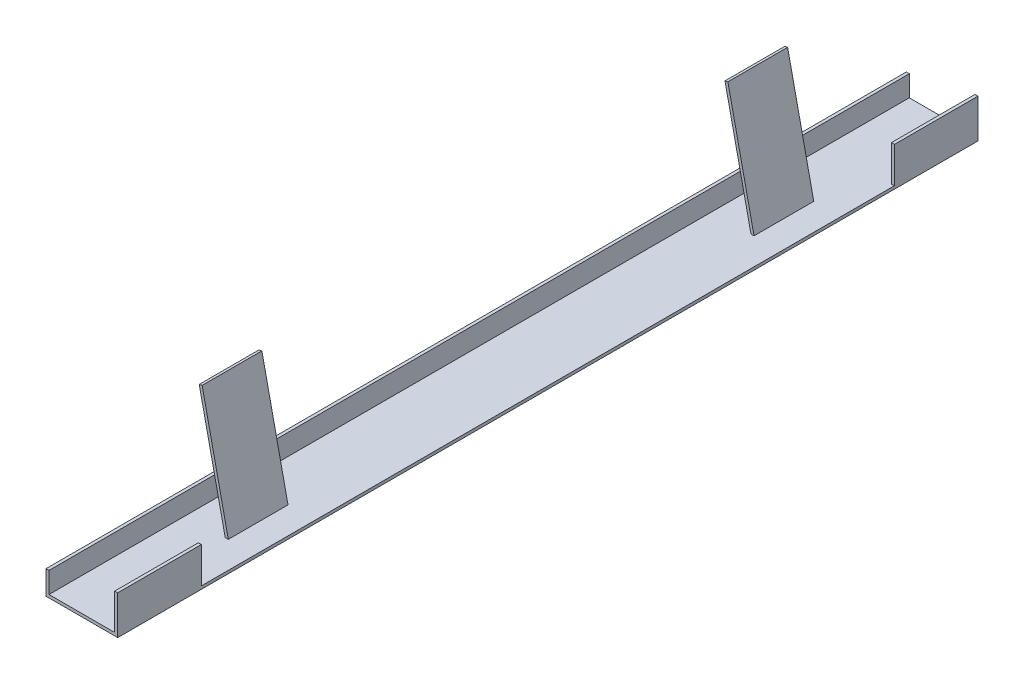
ISO-10303-21;
HEADER;
FILE_DESCRIPTION(('STEP AP214'),'2;1');
FILE_NAME('part.step','',(''),(''),'','','');
FILE_SCHEMA(('AUTOMOTIVE_DESIGN { 1 0 10303 214 1 1 1 1 }'));
ENDSEC;
DATA;
#1=APPLICATION_CONTEXT('core data for automotive mechanical design processes');
#2=APPLICATION_PROTOCOL_DEFINITION('international standard','automotive_design',2000,#1);
#3=PRODUCT_CONTEXT('',#1,'mechanical');
#4=PRODUCT('Part','Part','',(#3));
#5=PRODUCT_RELATED_PRODUCT_CATEGORY('part','',(#4));
#6=PRODUCT_DEFINITION_FORMATION('','',#4);
#7=PRODUCT_DEFINITION_CONTEXT('part definition',#1,'design');
#8=PRODUCT_DEFINITION('design','',#6,#7);
#9=PRODUCT_DEFINITION_SHAPE('','',#8);
#10=(LENGTH_UNIT() NAMED_UNIT(*) SI_UNIT(.MILLI.,.METRE.));
#11=(NAMED_UNIT(*) PLANE_ANGLE_UNIT() SI_UNIT($,.RADIAN.));
#12=(NAMED_UNIT(*) SI_UNIT($,.STERADIAN.) SOLID_ANGLE_UNIT());
#13=UNCERTAINTY_MEASURE_WITH_UNIT(LENGTH_MEASURE(1.E-05),#10,'distance_accuracy_value','');
#14=(GEOMETRIC_REPRESENTATION_CONTEXT(3) GLOBAL_UNCERTAINTY_ASSIGNED_CONTEXT((#13)) GLOBAL_UNIT_ASSIGNED_CONTEXT((#10,
#11,#12)) REPRESENTATION_CONTEXT('',''));
#15=CARTESIAN_POINT('',(0.,0.,0.));
#16=DIRECTION('',(0.,0.,1.));
#17=DIRECTION('',(1.,0.,0.));
#18=AXIS2_PLACEMENT_3D('',#15,#16,#17);
#19=CARTESIAN_POINT('',(139.7,0.,228.6));
#20=DIRECTION('',(-1.,0.,0.));
#21=DIRECTION('',(0.,0.,1.));
#22=AXIS2_PLACEMENT_3D('',#19,#20,#21);
#23=PLANE('',#22);
#24=DIRECTION('',(0.,1.,0.));
#25=VECTOR('',#24,1.);
#26=CARTESIAN_POINT('',(139.7,1.5875,-184.15));
#27=LINE('',#26,#25);
#28=CARTESIAN_POINT('',(139.7,1.5875,-184.15));
#29=VERTEX_POINT('',#28);
#30=CARTESIAN_POINT('',(139.7,20.6375,-184.15));
#31=VERTEX_POINT('',#30);
#32=EDGE_CURVE('E184',#29,#31,#27,.T.);
#33=ORIENTED_EDGE('',*,*,#32,.F.);
#34=DIRECTION('',(0.,0.,1.));
#35=VECTOR('',#34,1.);
#36=CARTESIAN_POINT('',(139.7,1.5875,-184.15));
#37=LINE('',#36,#35);
#38=CARTESIAN_POINT('',(139.7,1.5875,184.15));
#39=VERTEX_POINT('',#38);
#40=EDGE_CURVE('E171',#29,#39,#37,.T.);
#41=ORIENTED_EDGE('',*,*,#40,.T.);
#42=DIRECTION('',(0.,1.,0.));
#43=VECTOR('',#42,1.);
#44=CARTESIAN_POINT('',(139.7,1.5875,184.15));
#45=LINE('',#44,#43);
#46=CARTESIAN_POINT('',(139.7,20.6375,184.15));
#47=VERTEX_POINT('',#46);
#48=EDGE_CURVE('E198',#39,#47,#45,.T.);
#49=ORIENTED_EDGE('',*,*,#48,.T.);
#50=DIRECTION('',(0.,0.,-1.));
#51=VECTOR('',#50,1.);
#52=CARTESIAN_POINT('',(139.7,20.6375,228.6));
#53=LINE('',#52,#51);
#54=CARTESIAN_POINT('',(139.7,20.6375,228.6));
#55=VERTEX_POINT('',#54);
#56=EDGE_CURVE('E299',#55,#47,#53,.T.);
#57=ORIENTED_EDGE('',*,*,#56,.F.);
#58=DIRECTION('',(0.,1.,0.));
#59=VECTOR('',#58,1.);
#60=CARTESIAN_POINT('',(139.7,0.,228.6));
#61=LINE('',#60,#59);
#62=CARTESIAN_POINT('',(139.7,0.,228.6));
#63=VERTEX_POINT('',#62);
#64=EDGE_CURVE('E248',#63,#55,#61,.T.);
#65=ORIENTED_EDGE('',*,*,#64,.F.);
#66=DIRECTION('',(0.,0.,-1.));
#67=VECTOR('',#66,1.);
#68=CARTESIAN_POINT('',(139.7,0.,228.6));
#69=LINE('',#68,#67);
#70=CARTESIAN_POINT('',(139.7,0.,-228.6));
#71=VERTEX_POINT('',#70);
#72=EDGE_CURVE('E302',#63,#71,#69,.T.);
#73=ORIENTED_EDGE('',*,*,#72,.T.);
#74=DIRECTION('',(0.,1.,0.));
#75=VECTOR('',#74,1.);
#76=CARTESIAN_POINT('',(139.7,0.,-228.6));
#77=LINE('',#76,#75);
#78=CARTESIAN_POINT('',(139.7,20.6375,-228.6));
#79=VERTEX_POINT('',#78);
#80=EDGE_CURVE('E265',#71,#79,#77,.T.);
#81=ORIENTED_EDGE('',*,*,#80,.T.);
#82=EDGE_CURVE('E189',#31,#79,#53,.T.);
#83=ORIENTED_EDGE('',*,*,#82,.F.);
#84=EDGE_LOOP('',(#33,#41,#49,#57,#65,#73,#81,#83));
#85=FACE_BOUND('',#84,.T.);
#86=ADVANCED_FACE('F31',(#85),#23,.F.);
#87=CARTESIAN_POINT('',(139.7,20.6375,228.6));
#88=DIRECTION('',(0.,-1.,0.));
#89=DIRECTION('',(0.,0.,-1.));
#90=AXIS2_PLACEMENT_3D('',#87,#88,#89);
#91=PLANE('',#90);
#92=DIRECTION('',(-1.,0.,0.));
#93=VECTOR('',#92,1.);
#94=CARTESIAN_POINT('',(139.7,20.6375,-184.15));
#95=LINE('',#94,#93);
#96=CARTESIAN_POINT('',(138.1125,20.6375,-184.15));
#97=VERTEX_POINT('',#96);
#98=EDGE_CURVE('E181',#31,#97,#95,.T.);
#99=ORIENTED_EDGE('',*,*,#98,.F.);
#100=ORIENTED_EDGE('',*,*,#82,.T.);
#101=DIRECTION('',(-1.,0.,0.));
#102=VECTOR('',#101,1.);
#103=CARTESIAN_POINT('',(139.7,20.6375,-228.6));
#104=LINE('',#103,#102);
#105=CARTESIAN_POINT('',(138.1125,20.6375,-228.6));
#106=VERTEX_POINT('',#105);
#107=EDGE_CURVE('E267',#79,#106,#104,.T.);
#108=ORIENTED_EDGE('',*,*,#107,.T.);
#109=DIRECTION('',(0.,0.,-1.));
#110=VECTOR('',#109,1.);
#111=CARTESIAN_POINT('',(138.1125,20.6375,228.6));
#112=LINE('',#111,#110);
#113=EDGE_CURVE('E295',#97,#106,#112,.T.);
#114=ORIENTED_EDGE('',*,*,#113,.F.);
#115=EDGE_LOOP('',(#99,#100,#108,#114));
#116=FACE_BOUND('',#115,.T.);
#117=ADVANCED_FACE('F340',(#116),#91,.F.);
#118=CARTESIAN_POINT('',(138.1125,20.6375,228.6));
#119=DIRECTION('',(1.,0.,0.));
#120=DIRECTION('',(0.,0.,-1.));
#121=AXIS2_PLACEMENT_3D('',#118,#119,#120);
#122=PLANE('',#121);
#123=DIRECTION('',(0.,-1.,0.));
#124=VECTOR('',#123,1.);
#125=CARTESIAN_POINT('',(138.1125,20.6375,-184.15));
#126=LINE('',#125,#124);
#127=CARTESIAN_POINT('',(138.1125,1.5875,-184.15));
#128=VERTEX_POINT('',#127);
#129=EDGE_CURVE('E46',#97,#128,#126,.T.);
#130=ORIENTED_EDGE('',*,*,#129,.F.);
#131=ORIENTED_EDGE('',*,*,#113,.T.);
#132=DIRECTION('',(0.,-1.,0.));
#133=VECTOR('',#132,1.);
#134=CARTESIAN_POINT('',(138.1125,20.6375,-228.6));
#135=LINE('',#134,#133);
#136=CARTESIAN_POINT('',(138.1125,1.5875,-228.6));
#137=VERTEX_POINT('',#136);
#138=EDGE_CURVE('E270',#106,#137,#135,.T.);
#139=ORIENTED_EDGE('',*,*,#138,.T.);
#140=DIRECTION('',(0.,0.,-1.));
#141=VECTOR('',#140,1.);
#142=CARTESIAN_POINT('',(138.1125,1.5875,228.6));
#143=LINE('',#142,#141);
#144=EDGE_CURVE('E292',#128,#137,#143,.T.);
#145=ORIENTED_EDGE('',*,*,#144,.F.);
#146=EDGE_LOOP('',(#130,#131,#139,#145));
#147=FACE_BOUND('',#146,.T.);
#148=ADVANCED_FACE('F337',(#147),#122,.F.);
#149=CARTESIAN_POINT('',(125.44957879554,1.5875,228.6));
#150=DIRECTION('',(-0.977176363917546,-0.212429644355218,0.));
#151=DIRECTION('',(0.212429644355218,-0.977176363917546,0.));
#152=AXIS2_PLACEMENT_3D('',#149,#150,#151);
#153=PLANE('',#152);
#154=DIRECTION('',(-0.212429644355218,0.977176363917546,0.));
#155=VECTOR('',#154,1.);
#156=CARTESIAN_POINT('',(125.44957879554,1.5875,155.575));
#157=LINE('',#156,#155);
#158=CARTESIAN_POINT('',(125.44957879554,1.5875,155.575));
#159=VERTEX_POINT('',#158);
#160=CARTESIAN_POINT('',(111.54975300114,65.52669864662,155.575));
#161=VERTEX_POINT('',#160);
#162=EDGE_CURVE('E218',#159,#161,#157,.T.);
#163=ORIENTED_EDGE('',*,*,#162,.F.);
#164=DIRECTION('',(0.,0.,-1.));
#165=VECTOR('',#164,1.);
#166=CARTESIAN_POINT('',(125.44957879554,1.5875,228.6));
#167=LINE('',#166,#165);
#168=CARTESIAN_POINT('',(125.44957879554,1.5875,123.825));
#169=VERTEX_POINT('',#168);
#170=EDGE_CURVE('E290',#159,#169,#167,.T.);
#171=ORIENTED_EDGE('',*,*,#170,.T.);
#172=DIRECTION('',(-0.212429644355218,0.977176363917546,0.));
#173=VECTOR('',#172,1.);
#174=CARTESIAN_POINT('',(125.44957879554,1.5875,123.825));
#175=LINE('',#174,#173);
#176=CARTESIAN_POINT('',(111.54975300114,65.52669864662,123.825));
#177=VERTEX_POINT('',#176);
#178=EDGE_CURVE('E232',#169,#177,#175,.T.);
#179=ORIENTED_EDGE('',*,*,#178,.T.);
#180=DIRECTION('',(0.,0.,-1.));
#181=VECTOR('',#180,1.);
#182=CARTESIAN_POINT('',(111.54975300114,65.52669864662,228.6));
#183=LINE('',#182,#181);
#184=EDGE_CURVE('E287',#161,#177,#183,.T.);
#185=ORIENTED_EDGE('',*,*,#184,.F.);
#186=EDGE_LOOP('',(#163,#171,#179,#185));
#187=FACE_BOUND('',#186,.T.);
#188=ADVANCED_FACE('F348',(#187),#153,.F.);
#189=CARTESIAN_POINT('',(111.54975300114,65.52669864662,228.6));
#190=DIRECTION('',(0.212429643401076,-0.977176364124968,0.));
#191=DIRECTION('',(0.977176364124968,0.212429643401076,0.));
#192=AXIS2_PLACEMENT_3D('',#189,#190,#191);
#193=PLANE('',#192);
#194=DIRECTION('',(-0.977176364124968,-0.212429643401076,0.));
#195=VECTOR('',#194,1.);
#196=CARTESIAN_POINT('',(111.54975300114,65.52669864662,155.575));
#197=LINE('',#196,#195);
#198=CARTESIAN_POINT('',(109.99848552456,65.18946658804,155.575));
#199=VERTEX_POINT('',#198);
#200=EDGE_CURVE('E214',#161,#199,#197,.T.);
#201=ORIENTED_EDGE('',*,*,#200,.F.);
#202=ORIENTED_EDGE('',*,*,#184,.T.);
#203=DIRECTION('',(-0.977176364124968,-0.212429643401076,0.));
#204=VECTOR('',#203,1.);
#205=CARTESIAN_POINT('',(111.54975300114,65.52669864662,123.825));
#206=LINE('',#205,#204);
#207=CARTESIAN_POINT('',(109.99848552456,65.18946658804,123.825));
#208=VERTEX_POINT('',#207);
#209=EDGE_CURVE('E224',#177,#208,#206,.T.);
#210=ORIENTED_EDGE('',*,*,#209,.T.);
#211=DIRECTION('',(0.,0.,-1.));
#212=VECTOR('',#211,1.);
#213=CARTESIAN_POINT('',(109.99848552456,65.18946658804,228.6));
#214=LINE('',#213,#212);
#215=EDGE_CURVE('E284',#199,#208,#214,.T.);
#216=ORIENTED_EDGE('',*,*,#215,.F.);
#217=EDGE_LOOP('',(#201,#202,#210,#216));
#218=FACE_BOUND('',#217,.T.);
#219=ADVANCED_FACE('F400',(#218),#193,.F.);
#220=CARTESIAN_POINT('',(109.99848552456,65.18946658804,228.6));
#221=DIRECTION('',(0.977176363923505,0.212429644327803,0.));
#222=DIRECTION('',(-0.212429644327804,0.977176363923505,0.));
#223=AXIS2_PLACEMENT_3D('',#220,#221,#222);
#224=PLANE('',#223);
#225=DIRECTION('',(0.212429644327804,-0.977176363923505,0.));
#226=VECTOR('',#225,1.);
#227=CARTESIAN_POINT('',(109.99848552456,65.18946658804,155.575));
#228=LINE('',#227,#226);
#229=CARTESIAN_POINT('',(123.825,1.5875,155.575));
#230=VERTEX_POINT('',#229);
#231=EDGE_CURVE('E216',#199,#230,#228,.T.);
#232=ORIENTED_EDGE('',*,*,#231,.F.);
#233=ORIENTED_EDGE('',*,*,#215,.T.);
#234=DIRECTION('',(0.212429644327804,-0.977176363923505,0.));
#235=VECTOR('',#234,1.);
#236=CARTESIAN_POINT('',(109.99848552456,65.18946658804,123.825));
#237=LINE('',#236,#235);
#238=CARTESIAN_POINT('',(123.825,1.5875,123.825));
#239=VERTEX_POINT('',#238);
#240=EDGE_CURVE('E226',#208,#239,#237,.T.);
#241=ORIENTED_EDGE('',*,*,#240,.T.);
#242=DIRECTION('',(0.,0.,-1.));
#243=VECTOR('',#242,1.);
#244=CARTESIAN_POINT('',(123.825,1.5875,228.6));
#245=LINE('',#244,#243);
#246=EDGE_CURVE('E54',#230,#239,#245,.T.);
#247=ORIENTED_EDGE('',*,*,#246,.F.);
#248=EDGE_LOOP('',(#232,#233,#241,#247));
#249=FACE_BOUND('',#248,.T.);
#250=ADVANCED_FACE('F396',(#249),#224,.F.);
#251=CARTESIAN_POINT('',(125.44957879554,1.5875,-123.825));
#252=VERTEX_POINT('',#251);
#253=CARTESIAN_POINT('',(125.44957879554,1.5875,-155.575));
#254=VERTEX_POINT('',#253);
#255=EDGE_CURVE('E289',#252,#254,#167,.T.);
#256=ORIENTED_EDGE('',*,*,#255,.T.);
#257=DIRECTION('',(-0.212429644355218,0.977176363917546,0.));
#258=VECTOR('',#257,1.);
#259=CARTESIAN_POINT('',(125.44957879554,1.5875,-155.575));
#260=LINE('',#259,#258);
#261=CARTESIAN_POINT('',(111.54975300114,65.52669864662,-155.575));
#262=VERTEX_POINT('',#261);
#263=EDGE_CURVE('E209',#254,#262,#260,.T.);
#264=ORIENTED_EDGE('',*,*,#263,.T.);
#265=CARTESIAN_POINT('',(111.54975300114,65.52669864662,-123.825));
#266=VERTEX_POINT('',#265);
#267=EDGE_CURVE('E286',#266,#262,#183,.T.);
#268=ORIENTED_EDGE('',*,*,#267,.F.);
#269=DIRECTION('',(-0.212429644355218,0.977176363917546,0.));
#270=VECTOR('',#269,1.);
#271=CARTESIAN_POINT('',(125.44957879554,1.5875,-123.825));
#272=LINE('',#271,#270);
#273=EDGE_CURVE('E237',#252,#266,#272,.T.);
#274=ORIENTED_EDGE('',*,*,#273,.F.);
#275=EDGE_LOOP('',(#256,#264,#268,#274));
#276=FACE_BOUND('',#275,.T.);
#277=ADVANCED_FACE('F399',(#276),#153,.F.);
#278=ORIENTED_EDGE('',*,*,#267,.T.);
#279=DIRECTION('',(0.977176364124968,0.212429643401076,0.));
#280=VECTOR('',#279,1.);
#281=CARTESIAN_POINT('',(109.99848552456,65.18946658804,-155.575));
#282=LINE('',#281,#280);
#283=CARTESIAN_POINT('',(109.99848552456,65.18946658804,-155.575));
#284=VERTEX_POINT('',#283);
#285=EDGE_CURVE('E204',#284,#262,#282,.T.);
#286=ORIENTED_EDGE('',*,*,#285,.F.);
#287=CARTESIAN_POINT('',(109.99848552456,65.18946658804,-123.825));
#288=VERTEX_POINT('',#287);
#289=EDGE_CURVE('E283',#288,#284,#214,.T.);
#290=ORIENTED_EDGE('',*,*,#289,.F.);
#291=DIRECTION('',(-0.977176364124968,-0.212429643401076,0.));
#292=VECTOR('',#291,1.);
#293=CARTESIAN_POINT('',(111.54975300114,65.52669864662,-123.825));
#294=LINE('',#293,#292);
#295=EDGE_CURVE('E223',#266,#288,#294,.T.);
#296=ORIENTED_EDGE('',*,*,#295,.F.);
#297=EDGE_LOOP('',(#278,#286,#290,#296));
#298=FACE_BOUND('',#297,.T.);
#299=ADVANCED_FACE('F406',(#298),#193,.F.);
#300=ORIENTED_EDGE('',*,*,#289,.T.);
#301=DIRECTION('',(0.212429644327804,-0.977176363923505,0.));
#302=VECTOR('',#301,1.);
#303=CARTESIAN_POINT('',(109.99848552456,65.18946658804,-155.575));
#304=LINE('',#303,#302);
#305=CARTESIAN_POINT('',(123.825,1.5875,-155.575));
#306=VERTEX_POINT('',#305);
#307=EDGE_CURVE('E206',#284,#306,#304,.T.);
#308=ORIENTED_EDGE('',*,*,#307,.T.);
#309=CARTESIAN_POINT('',(123.825,1.5875,-123.825));
#310=VERTEX_POINT('',#309);
#311=EDGE_CURVE('E281',#310,#306,#245,.T.);
#312=ORIENTED_EDGE('',*,*,#311,.F.);
#313=DIRECTION('',(0.212429644327804,-0.977176363923505,0.));
#314=VECTOR('',#313,1.);
#315=CARTESIAN_POINT('',(109.99848552456,65.18946658804,-123.825));
#316=LINE('',#315,#314);
#317=EDGE_CURVE('E235',#288,#310,#316,.T.);
#318=ORIENTED_EDGE('',*,*,#317,.F.);
#319=EDGE_LOOP('',(#300,#308,#312,#318));
#320=FACE_BOUND('',#319,.T.);
#321=ADVANCED_FACE('F402',(#320),#224,.F.);
#322=CARTESIAN_POINT('',(103.1875,12.7,228.6));
#323=DIRECTION('',(0.,-1.,0.));
#324=DIRECTION('',(0.,0.,-1.));
#325=AXIS2_PLACEMENT_3D('',#322,#323,#324);
#326=PLANE('',#325);
#327=DIRECTION('',(-1.,0.,0.));
#328=VECTOR('',#327,1.);
#329=CARTESIAN_POINT('',(103.1875,12.7,-228.6));
#330=LINE('',#329,#328);
#331=CARTESIAN_POINT('',(103.1875,12.7,-228.6));
#332=VERTEX_POINT('',#331);
#333=CARTESIAN_POINT('',(101.6,12.7,-228.6));
#334=VERTEX_POINT('',#333);
#335=EDGE_CURVE('E239',#332,#334,#330,.T.);
#336=ORIENTED_EDGE('',*,*,#335,.T.);
#337=DIRECTION('',(0.,0.,-1.));
#338=VECTOR('',#337,1.);
#339=CARTESIAN_POINT('',(101.6,12.7,228.6));
#340=LINE('',#339,#338);
#341=CARTESIAN_POINT('',(101.6,12.7,228.6));
#342=VERTEX_POINT('',#341);
#343=EDGE_CURVE('E11',#342,#334,#340,.T.);
#344=ORIENTED_EDGE('',*,*,#343,.F.);
#345=DIRECTION('',(-1.,0.,0.));
#346=VECTOR('',#345,1.);
#347=CARTESIAN_POINT('',(103.1875,12.7,228.6));
#348=LINE('',#347,#346);
#349=CARTESIAN_POINT('',(103.1875,12.7,228.6));
#350=VERTEX_POINT('',#349);
#351=EDGE_CURVE('E240',#350,#342,#348,.T.);
#352=ORIENTED_EDGE('',*,*,#351,.F.);
#353=DIRECTION('',(0.,0.,-1.));
#354=VECTOR('',#353,1.);
#355=CARTESIAN_POINT('',(103.1875,12.7,228.6));
#356=LINE('',#355,#354);
#357=EDGE_CURVE('E258',#350,#332,#356,.T.);
#358=ORIENTED_EDGE('',*,*,#357,.T.);
#359=EDGE_LOOP('',(#336,#344,#352,#358));
#360=FACE_BOUND('',#359,.T.);
#361=ADVANCED_FACE('F33',(#360),#326,.F.);
#362=CARTESIAN_POINT('',(101.6,12.7,228.6));
#363=DIRECTION('',(1.,0.,0.));
#364=DIRECTION('',(0.,0.,-1.));
#365=AXIS2_PLACEMENT_3D('',#362,#363,#364);
#366=PLANE('',#365);
#367=DIRECTION('',(0.,-1.,0.));
#368=VECTOR('',#367,1.);
#369=CARTESIAN_POINT('',(101.6,12.7,-228.6));
#370=LINE('',#369,#368);
#371=CARTESIAN_POINT('',(101.6,0.,-228.6));
#372=VERTEX_POINT('',#371);
#373=EDGE_CURVE('E261',#334,#372,#370,.T.);
#374=ORIENTED_EDGE('',*,*,#373,.T.);
#375=DIRECTION('',(0.,0.,-1.));
#376=VECTOR('',#375,1.);
#377=CARTESIAN_POINT('',(101.6,0.,228.6));
#378=LINE('',#377,#376);
#379=CARTESIAN_POINT('',(101.6,0.,228.6));
#380=VERTEX_POINT('',#379);
#381=EDGE_CURVE('E39',#380,#372,#378,.T.);
#382=ORIENTED_EDGE('',*,*,#381,.F.);
#383=DIRECTION('',(0.,-1.,0.));
#384=VECTOR('',#383,1.);
#385=CARTESIAN_POINT('',(101.6,12.7,228.6));
#386=LINE('',#385,#384);
#387=EDGE_CURVE('E243',#342,#380,#386,.T.);
#388=ORIENTED_EDGE('',*,*,#387,.F.);
#389=ORIENTED_EDGE('',*,*,#343,.T.);
#390=EDGE_LOOP('',(#374,#382,#388,#389));
#391=FACE_BOUND('',#390,.T.);
#392=ADVANCED_FACE('F327',(#391),#366,.F.);
#393=CARTESIAN_POINT('',(101.6,0.,228.6));
#394=DIRECTION('',(0.,1.,0.));
#395=DIRECTION('',(0.,0.,1.));
#396=AXIS2_PLACEMENT_3D('',#393,#394,#395);
#397=PLANE('',#396);
#398=DIRECTION('',(1.,0.,0.));
#399=VECTOR('',#398,1.);
#400=CARTESIAN_POINT('',(101.6,0.,-228.6));
#401=LINE('',#400,#399);
#402=EDGE_CURVE('E263',#372,#71,#401,.T.);
#403=ORIENTED_EDGE('',*,*,#402,.T.);
#404=ORIENTED_EDGE('',*,*,#72,.F.);
#405=DIRECTION('',(1.,0.,0.));
#406=VECTOR('',#405,1.);
#407=CARTESIAN_POINT('',(101.6,0.,228.6));
#408=LINE('',#407,#406);
#409=EDGE_CURVE('E246',#380,#63,#408,.T.);
#410=ORIENTED_EDGE('',*,*,#409,.F.);
#411=ORIENTED_EDGE('',*,*,#381,.T.);
#412=EDGE_LOOP('',(#403,#404,#410,#411));
#413=FACE_BOUND('',#412,.T.);
#414=ADVANCED_FACE('F309',(#413),#397,.F.);
#415=ORIENTED_EDGE('',*,*,#56,.T.);
#416=DIRECTION('',(-1.,0.,0.));
#417=VECTOR('',#416,1.);
#418=CARTESIAN_POINT('',(139.7,20.6375,184.15));
#419=LINE('',#418,#417);
#420=CARTESIAN_POINT('',(138.1125,20.6375,184.15));
#421=VERTEX_POINT('',#420);
#422=EDGE_CURVE('E200',#47,#421,#419,.T.);
#423=ORIENTED_EDGE('',*,*,#422,.T.);
#424=CARTESIAN_POINT('',(138.1125,20.6375,228.6));
#425=VERTEX_POINT('',#424);
#426=EDGE_CURVE('E296',#425,#421,#112,.T.);
#427=ORIENTED_EDGE('',*,*,#426,.F.);
#428=DIRECTION('',(-1.,0.,0.));
#429=VECTOR('',#428,1.);
#430=CARTESIAN_POINT('',(139.7,20.6375,228.6));
#431=LINE('',#430,#429);
#432=EDGE_CURVE('E250',#55,#425,#431,.T.);
#433=ORIENTED_EDGE('',*,*,#432,.F.);
#434=EDGE_LOOP('',(#415,#423,#427,#433));
#435=FACE_BOUND('',#434,.T.);
#436=ADVANCED_FACE('F343',(#435),#91,.F.);
#437=ORIENTED_EDGE('',*,*,#426,.T.);
#438=DIRECTION('',(0.,-1.,0.));
#439=VECTOR('',#438,1.);
#440=CARTESIAN_POINT('',(138.1125,20.6375,184.15));
#441=LINE('',#440,#439);
#442=CARTESIAN_POINT('',(138.1125,1.5875,184.15));
#443=VERTEX_POINT('',#442);
#444=EDGE_CURVE('E194',#421,#443,#441,.T.);
#445=ORIENTED_EDGE('',*,*,#444,.T.);
#446=CARTESIAN_POINT('',(138.1125,1.5875,228.6));
#447=VERTEX_POINT('',#446);
#448=EDGE_CURVE('E293',#447,#443,#143,.T.);
#449=ORIENTED_EDGE('',*,*,#448,.F.);
#450=DIRECTION('',(0.,-1.,0.));
#451=VECTOR('',#450,1.);
#452=CARTESIAN_POINT('',(138.1125,20.6375,228.6));
#453=LINE('',#452,#451);
#454=EDGE_CURVE('E252',#425,#447,#453,.T.);
#455=ORIENTED_EDGE('',*,*,#454,.F.);
#456=EDGE_LOOP('',(#437,#445,#449,#455));
#457=FACE_BOUND('',#456,.T.);
#458=ADVANCED_FACE('F350',(#457),#122,.F.);
#459=CARTESIAN_POINT('',(123.825,1.5875,228.6));
#460=DIRECTION('',(0.,-1.,0.));
#461=DIRECTION('',(1.,0.,0.));
#462=AXIS2_PLACEMENT_3D('',#459,#460,#461);
#463=PLANE('',#462);
#464=DIRECTION('',(-1.,0.,0.));
#465=VECTOR('',#464,1.);
#466=CARTESIAN_POINT('',(138.1125,1.5875,-155.575));
#467=LINE('',#466,#465);
#468=EDGE_CURVE('E180',#254,#306,#467,.T.);
#469=ORIENTED_EDGE('',*,*,#468,.F.);
#470=ORIENTED_EDGE('',*,*,#255,.F.);
#471=DIRECTION('',(1.,0.,0.));
#472=VECTOR('',#471,1.);
#473=CARTESIAN_POINT('',(103.1875,1.5875,-123.825));
#474=LINE('',#473,#472);
#475=EDGE_CURVE('E221',#310,#252,#474,.T.);
#476=ORIENTED_EDGE('',*,*,#475,.F.);
#477=ORIENTED_EDGE('',*,*,#311,.T.);
#478=EDGE_LOOP('',(#469,#470,#476,#477));
#479=FACE_BOUND('',#478,.T.);
#480=ORIENTED_EDGE('',*,*,#170,.F.);
#481=DIRECTION('',(1.,0.,0.));
#482=VECTOR('',#481,1.);
#483=CARTESIAN_POINT('',(103.1875,1.5875,155.575));
#484=LINE('',#483,#482);
#485=EDGE_CURVE('E212',#230,#159,#484,.T.);
#486=ORIENTED_EDGE('',*,*,#485,.F.);
#487=ORIENTED_EDGE('',*,*,#246,.T.);
#488=DIRECTION('',(1.,0.,0.));
#489=VECTOR('',#488,1.);
#490=CARTESIAN_POINT('',(103.1875,1.5875,123.825));
#491=LINE('',#490,#489);
#492=EDGE_CURVE('E220',#239,#169,#491,.T.);
#493=ORIENTED_EDGE('',*,*,#492,.T.);
#494=EDGE_LOOP('',(#480,#486,#487,#493));
#495=FACE_BOUND('',#494,.T.);
#496=ORIENTED_EDGE('',*,*,#448,.T.);
#497=DIRECTION('',(1.,0.,0.));
#498=VECTOR('',#497,1.);
#499=CARTESIAN_POINT('',(138.1125,1.5875,184.15));
#500=LINE('',#499,#498);
#501=EDGE_CURVE('E176',#443,#39,#500,.T.);
#502=ORIENTED_EDGE('',*,*,#501,.T.);
#503=ORIENTED_EDGE('',*,*,#40,.F.);
#504=DIRECTION('',(1.,0.,0.));
#505=VECTOR('',#504,1.);
#506=CARTESIAN_POINT('',(138.1125,1.5875,-184.15));
#507=LINE('',#506,#505);
#508=EDGE_CURVE('E174',#128,#29,#507,.T.);
#509=ORIENTED_EDGE('',*,*,#508,.F.);
#510=ORIENTED_EDGE('',*,*,#144,.T.);
#511=DIRECTION('',(-1.,0.,0.));
#512=VECTOR('',#511,1.);
#513=CARTESIAN_POINT('',(123.825,1.5875,-228.6));
#514=LINE('',#513,#512);
#515=CARTESIAN_POINT('',(103.1875,1.5875,-228.6));
#516=VERTEX_POINT('',#515);
#517=EDGE_CURVE('E273',#137,#516,#514,.T.);
#518=ORIENTED_EDGE('',*,*,#517,.T.);
#519=DIRECTION('',(0.,0.,-1.));
#520=VECTOR('',#519,1.);
#521=CARTESIAN_POINT('',(103.1875,1.5875,228.6));
#522=LINE('',#521,#520);
#523=CARTESIAN_POINT('',(103.1875,1.5875,228.6));
#524=VERTEX_POINT('',#523);
#525=EDGE_CURVE('E279',#524,#516,#522,.T.);
#526=ORIENTED_EDGE('',*,*,#525,.F.);
#527=DIRECTION('',(-1.,0.,0.));
#528=VECTOR('',#527,1.);
#529=CARTESIAN_POINT('',(138.1125,1.5875,228.6));
#530=LINE('',#529,#528);
#531=EDGE_CURVE('E254',#447,#524,#530,.T.);
#532=ORIENTED_EDGE('',*,*,#531,.F.);
#533=EDGE_LOOP('',(#496,#502,#503,#509,#510,#518,#526,#532));
#534=FACE_BOUND('',#533,.T.);
#535=ADVANCED_FACE('F173',(#479,#495,#534),#463,.F.);
#536=CARTESIAN_POINT('',(103.1875,1.5875,228.6));
#537=DIRECTION('',(-1.,0.,0.));
#538=DIRECTION('',(0.,0.,1.));
#539=AXIS2_PLACEMENT_3D('',#536,#537,#538);
#540=PLANE('',#539);
#541=ORIENTED_EDGE('',*,*,#525,.T.);
#542=DIRECTION('',(0.,1.,0.));
#543=VECTOR('',#542,1.);
#544=CARTESIAN_POINT('',(103.1875,1.5875,-228.6));
#545=LINE('',#544,#543);
#546=EDGE_CURVE('E244',#516,#332,#545,.T.);
#547=ORIENTED_EDGE('',*,*,#546,.T.);
#548=ORIENTED_EDGE('',*,*,#357,.F.);
#549=DIRECTION('',(0.,1.,0.));
#550=VECTOR('',#549,1.);
#551=CARTESIAN_POINT('',(103.1875,1.5875,228.6));
#552=LINE('',#551,#550);
#553=EDGE_CURVE('E256',#524,#350,#552,.T.);
#554=ORIENTED_EDGE('',*,*,#553,.F.);
#555=EDGE_LOOP('',(#541,#547,#548,#554));
#556=FACE_BOUND('',#555,.T.);
#557=ADVANCED_FACE('F332',(#556),#540,.F.);
#558=CARTESIAN_POINT('',(101.6,12.7,228.6));
#559=DIRECTION('',(0.,0.,1.));
#560=DIRECTION('',(1.,0.,0.));
#561=AXIS2_PLACEMENT_3D('',#558,#559,#560);
#562=PLANE('',#561);
#563=ORIENTED_EDGE('',*,*,#531,.T.);
#564=ORIENTED_EDGE('',*,*,#553,.T.);
#565=ORIENTED_EDGE('',*,*,#351,.T.);
#566=ORIENTED_EDGE('',*,*,#387,.T.);
#567=ORIENTED_EDGE('',*,*,#409,.T.);
#568=ORIENTED_EDGE('',*,*,#64,.T.);
#569=ORIENTED_EDGE('',*,*,#432,.T.);
#570=ORIENTED_EDGE('',*,*,#454,.T.);
#571=EDGE_LOOP('',(#563,#564,#565,#566,#567,#568,#569,#570));
#572=FACE_BOUND('',#571,.T.);
#573=ADVANCED_FACE('F323',(#572),#562,.T.);
#574=CARTESIAN_POINT('',(101.6,12.7,-228.6));
#575=DIRECTION('',(0.,0.,1.));
#576=DIRECTION('',(1.,0.,0.));
#577=AXIS2_PLACEMENT_3D('',#574,#575,#576);
#578=PLANE('',#577);
#579=ORIENTED_EDGE('',*,*,#517,.F.);
#580=ORIENTED_EDGE('',*,*,#138,.F.);
#581=ORIENTED_EDGE('',*,*,#107,.F.);
#582=ORIENTED_EDGE('',*,*,#80,.F.);
#583=ORIENTED_EDGE('',*,*,#402,.F.);
#584=ORIENTED_EDGE('',*,*,#373,.F.);
#585=ORIENTED_EDGE('',*,*,#335,.F.);
#586=ORIENTED_EDGE('',*,*,#546,.F.);
#587=EDGE_LOOP('',(#579,#580,#581,#582,#583,#584,#585,#586));
#588=FACE_BOUND('',#587,.T.);
#589=ADVANCED_FACE('F315',(#588),#578,.F.);
#590=CARTESIAN_POINT('',(103.1875,1.5875,-123.825));
#591=DIRECTION('',(0.,0.,1.));
#592=DIRECTION('',(1.,0.,0.));
#593=AXIS2_PLACEMENT_3D('',#590,#591,#592);
#594=PLANE('',#593);
#595=ORIENTED_EDGE('',*,*,#273,.T.);
#596=ORIENTED_EDGE('',*,*,#295,.T.);
#597=ORIENTED_EDGE('',*,*,#317,.T.);
#598=ORIENTED_EDGE('',*,*,#475,.T.);
#599=EDGE_LOOP('',(#595,#596,#597,#598));
#600=FACE_BOUND('',#599,.T.);
#601=ADVANCED_FACE('F380',(#600),#594,.T.);
#602=CARTESIAN_POINT('',(103.1875,1.5875,123.825));
#603=DIRECTION('',(0.,0.,1.));
#604=DIRECTION('',(1.,0.,0.));
#605=AXIS2_PLACEMENT_3D('',#602,#603,#604);
#606=PLANE('',#605);
#607=ORIENTED_EDGE('',*,*,#492,.F.);
#608=ORIENTED_EDGE('',*,*,#240,.F.);
#609=ORIENTED_EDGE('',*,*,#209,.F.);
#610=ORIENTED_EDGE('',*,*,#178,.F.);
#611=EDGE_LOOP('',(#607,#608,#609,#610));
#612=FACE_BOUND('',#611,.T.);
#613=ADVANCED_FACE('F378',(#612),#606,.F.);
#614=CARTESIAN_POINT('',(101.745552090037,1.5875,155.575));
#615=DIRECTION('',(0.,0.,1.));
#616=DIRECTION('',(1.,0.,0.));
#617=AXIS2_PLACEMENT_3D('',#614,#615,#616);
#618=PLANE('',#617);
#619=ORIENTED_EDGE('',*,*,#162,.T.);
#620=ORIENTED_EDGE('',*,*,#200,.T.);
#621=ORIENTED_EDGE('',*,*,#231,.T.);
#622=ORIENTED_EDGE('',*,*,#485,.T.);
#623=EDGE_LOOP('',(#619,#620,#621,#622));
#624=FACE_BOUND('',#623,.T.);
#625=ADVANCED_FACE('F374',(#624),#618,.T.);
#626=CARTESIAN_POINT('',(111.54975300114,65.52669864662,-155.575));
#627=DIRECTION('',(0.,0.,1.));
#628=DIRECTION('',(1.,0.,0.));
#629=AXIS2_PLACEMENT_3D('',#626,#627,#628);
#630=PLANE('',#629);
#631=ORIENTED_EDGE('',*,*,#468,.T.);
#632=ORIENTED_EDGE('',*,*,#307,.F.);
#633=ORIENTED_EDGE('',*,*,#285,.T.);
#634=ORIENTED_EDGE('',*,*,#263,.F.);
#635=EDGE_LOOP('',(#631,#632,#633,#634));
#636=FACE_BOUND('',#635,.T.);
#637=ADVANCED_FACE('F369',(#636),#630,.F.);
#638=CARTESIAN_POINT('',(138.1125,1.5875,-184.15));
#639=DIRECTION('',(0.,0.,1.));
#640=DIRECTION('',(1.,0.,0.));
#641=AXIS2_PLACEMENT_3D('',#638,#639,#640);
#642=PLANE('',#641);
#643=ORIENTED_EDGE('',*,*,#129,.T.);
#644=ORIENTED_EDGE('',*,*,#508,.T.);
#645=ORIENTED_EDGE('',*,*,#32,.T.);
#646=ORIENTED_EDGE('',*,*,#98,.T.);
#647=EDGE_LOOP('',(#643,#644,#645,#646));
#648=FACE_BOUND('',#647,.T.);
#649=ADVANCED_FACE('F183',(#648),#642,.T.);
#650=CARTESIAN_POINT('',(138.1125,1.5875,184.15));
#651=DIRECTION('',(0.,0.,1.));
#652=DIRECTION('',(1.,0.,0.));
#653=AXIS2_PLACEMENT_3D('',#650,#651,#652);
#654=PLANE('',#653);
#655=ORIENTED_EDGE('',*,*,#444,.F.);
#656=ORIENTED_EDGE('',*,*,#422,.F.);
#657=ORIENTED_EDGE('',*,*,#48,.F.);
#658=ORIENTED_EDGE('',*,*,#501,.F.);
#659=EDGE_LOOP('',(#655,#656,#657,#658));
#660=FACE_BOUND('',#659,.T.);
#661=ADVANCED_FACE('F363',(#660),#654,.F.);
#662=CLOSED_SHELL('',(#86,#117,#148,#188,#219,#250,#277,#299,#321,#361,#392,#414,#436,#458,#535,
#557,#573,#589,#601,#613,#625,#637,#649,#661));
#663=MANIFOLD_SOLID_BREP('B2',#662);
#664=ADVANCED_BREP_SHAPE_REPRESENTATION('',(#18,#663),#14);
#665=SHAPE_DEFINITION_REPRESENTATION(#9,#664);
ENDSEC;
END-ISO-10303-21;
